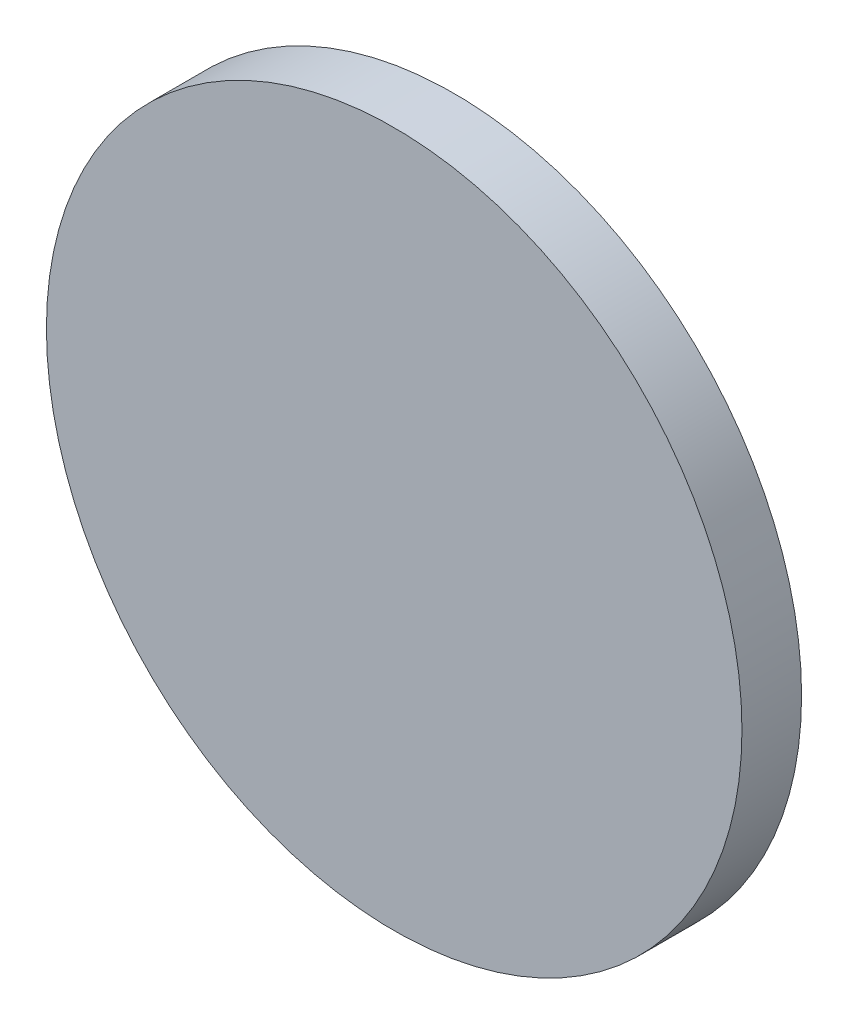
ISO-10303-21;
HEADER;
FILE_DESCRIPTION(('STEP AP214'),'2;1');
FILE_NAME('part.step','',(''),(''),'','','');
FILE_SCHEMA(('AUTOMOTIVE_DESIGN { 1 0 10303 214 1 1 1 1 }'));
ENDSEC;
DATA;
#1=APPLICATION_CONTEXT('core data for automotive mechanical design processes');
#2=APPLICATION_PROTOCOL_DEFINITION('international standard','automotive_design',2000,#1);
#3=PRODUCT_CONTEXT('',#1,'mechanical');
#4=PRODUCT('Part','Part','',(#3));
#5=PRODUCT_RELATED_PRODUCT_CATEGORY('part','',(#4));
#6=PRODUCT_DEFINITION_FORMATION('','',#4);
#7=PRODUCT_DEFINITION_CONTEXT('part definition',#1,'design');
#8=PRODUCT_DEFINITION('design','',#6,#7);
#9=PRODUCT_DEFINITION_SHAPE('','',#8);
#10=(LENGTH_UNIT() NAMED_UNIT(*) SI_UNIT(.MILLI.,.METRE.));
#11=(NAMED_UNIT(*) PLANE_ANGLE_UNIT() SI_UNIT($,.RADIAN.));
#12=(NAMED_UNIT(*) SI_UNIT($,.STERADIAN.) SOLID_ANGLE_UNIT());
#13=UNCERTAINTY_MEASURE_WITH_UNIT(LENGTH_MEASURE(1.E-05),#10,'distance_accuracy_value','');
#14=(GEOMETRIC_REPRESENTATION_CONTEXT(3) GLOBAL_UNCERTAINTY_ASSIGNED_CONTEXT((#13)) GLOBAL_UNIT_ASSIGNED_CONTEXT((#10,
#11,#12)) REPRESENTATION_CONTEXT('',''));
#15=CARTESIAN_POINT('',(0.,0.,0.));
#16=DIRECTION('',(0.,0.,1.));
#17=DIRECTION('',(1.,0.,0.));
#18=AXIS2_PLACEMENT_3D('',#15,#16,#17);
#19=CARTESIAN_POINT('',(1.35128,1.610360006176,0.76487));
#20=DIRECTION('',(0.,0.,-1.));
#21=DIRECTION('',(-1.,0.,0.));
#22=AXIS2_PLACEMENT_3D('',#19,#20,#21);
#23=PLANE('',#22);
#24=CARTESIAN_POINT('',(1.35128,1.610360006176,0.76487));
#25=DIRECTION('',(0.,0.,1.));
#26=DIRECTION('',(1.,0.,0.));
#27=AXIS2_PLACEMENT_3D('',#24,#25,#26);
#28=CIRCLE('',#27,0.200024667);
#29=CARTESIAN_POINT('',(1.551304667,1.610360006176,0.76487));
#30=VERTEX_POINT('',#29);
#31=EDGE_CURVE('E18',#30,#30,#28,.T.);
#32=ORIENTED_EDGE('',*,*,#31,.F.);
#33=EDGE_LOOP('',(#32));
#34=FACE_BOUND('',#33,.T.);
#35=ADVANCED_FACE('F15',(#34),#23,.T.);
#36=CARTESIAN_POINT('',(1.35128,1.610360006176,0.76487));
#37=DIRECTION('',(0.,0.,1.));
#38=DIRECTION('',(1.,0.,0.));
#39=AXIS2_PLACEMENT_3D('',#36,#37,#38);
#40=CYLINDRICAL_SURFACE('',#39,0.200024667);
#41=CARTESIAN_POINT('',(1.35128,1.610360006176,0.79916));
#42=DIRECTION('',(0.,0.,1.));
#43=DIRECTION('',(1.,0.,0.));
#44=AXIS2_PLACEMENT_3D('',#41,#42,#43);
#45=CIRCLE('',#44,0.200024667);
#46=CARTESIAN_POINT('',(1.551304667,1.610360006176,0.79916));
#47=VERTEX_POINT('',#46);
#48=EDGE_CURVE('E10',#47,#47,#45,.T.);
#49=ORIENTED_EDGE('',*,*,#48,.F.);
#50=EDGE_LOOP('',(#49));
#51=FACE_BOUND('',#50,.T.);
#52=ORIENTED_EDGE('',*,*,#31,.T.);
#53=EDGE_LOOP('',(#52));
#54=FACE_BOUND('',#53,.T.);
#55=ADVANCED_FACE('F27',(#51,#54),#40,.T.);
#56=CARTESIAN_POINT('',(1.35128,1.610360006176,0.79916));
#57=DIRECTION('',(0.,0.,1.));
#58=DIRECTION('',(1.,0.,0.));
#59=AXIS2_PLACEMENT_3D('',#56,#57,#58);
#60=PLANE('',#59);
#61=ORIENTED_EDGE('',*,*,#48,.T.);
#62=EDGE_LOOP('',(#61));
#63=FACE_BOUND('',#62,.T.);
#64=ADVANCED_FACE('F34',(#63),#60,.T.);
#65=CLOSED_SHELL('',(#35,#55,#64));
#66=MANIFOLD_SOLID_BREP('B1',#65);
#67=ADVANCED_BREP_SHAPE_REPRESENTATION('',(#18,#66),#14);
#68=SHAPE_DEFINITION_REPRESENTATION(#9,#67);
ENDSEC;
END-ISO-10303-21;
